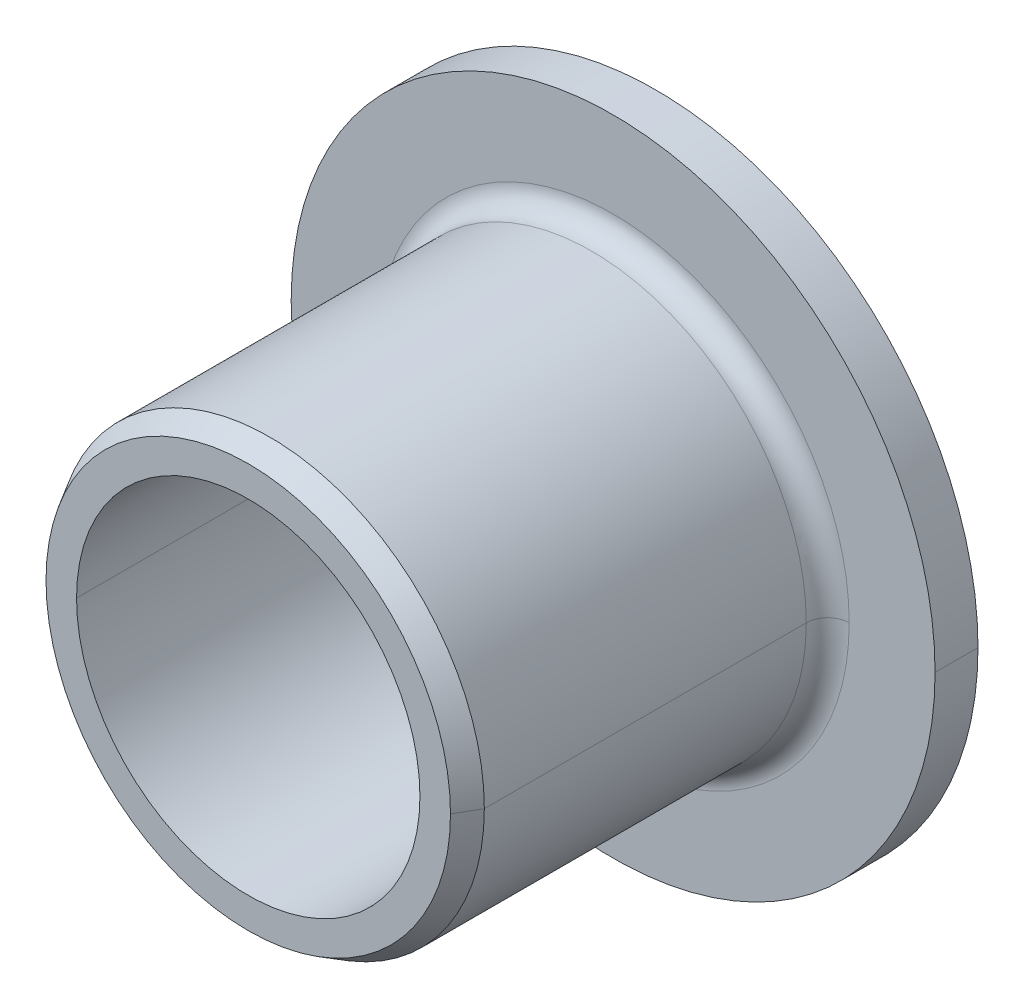
ISO-10303-21;
HEADER;
FILE_DESCRIPTION(('STEP AP214'),'2;1');
FILE_NAME('part.step','',(''),(''),'','','');
FILE_SCHEMA(('AUTOMOTIVE_DESIGN { 1 0 10303 214 1 1 1 1 }'));
ENDSEC;
DATA;
#1=APPLICATION_CONTEXT('core data for automotive mechanical design processes');
#2=APPLICATION_PROTOCOL_DEFINITION('international standard','automotive_design',2000,#1);
#3=PRODUCT_CONTEXT('',#1,'mechanical');
#4=PRODUCT('Part','Part','',(#3));
#5=PRODUCT_RELATED_PRODUCT_CATEGORY('part','',(#4));
#6=PRODUCT_DEFINITION_FORMATION('','',#4);
#7=PRODUCT_DEFINITION_CONTEXT('part definition',#1,'design');
#8=PRODUCT_DEFINITION('design','',#6,#7);
#9=PRODUCT_DEFINITION_SHAPE('','',#8);
#10=(LENGTH_UNIT() NAMED_UNIT(*) SI_UNIT(.MILLI.,.METRE.));
#11=(NAMED_UNIT(*) PLANE_ANGLE_UNIT() SI_UNIT($,.RADIAN.));
#12=(NAMED_UNIT(*) SI_UNIT($,.STERADIAN.) SOLID_ANGLE_UNIT());
#13=UNCERTAINTY_MEASURE_WITH_UNIT(LENGTH_MEASURE(1.E-05),#10,'distance_accuracy_value','');
#14=(GEOMETRIC_REPRESENTATION_CONTEXT(3) GLOBAL_UNCERTAINTY_ASSIGNED_CONTEXT((#13)) GLOBAL_UNIT_ASSIGNED_CONTEXT((#10,
#11,#12)) REPRESENTATION_CONTEXT('',''));
#15=CARTESIAN_POINT('',(0.,0.,0.));
#16=DIRECTION('',(0.,0.,1.));
#17=DIRECTION('',(1.,0.,0.));
#18=AXIS2_PLACEMENT_3D('',#15,#16,#17);
#19=CARTESIAN_POINT('',(5.75,0.,0.));
#20=DIRECTION('',(0.,0.,-1.));
#21=DIRECTION('',(0.,-1.,0.));
#22=AXIS2_PLACEMENT_3D('',#19,#20,#21);
#23=PLANE('',#22);
#24=CARTESIAN_POINT('',(0.,0.,0.));
#25=DIRECTION('',(0.,0.,1.));
#26=DIRECTION('',(1.,0.,0.));
#27=AXIS2_PLACEMENT_3D('',#24,#25,#26);
#28=CIRCLE('',#27,4.);
#29=CARTESIAN_POINT('',(4.,0.,0.));
#30=VERTEX_POINT('',#29);
#31=CARTESIAN_POINT('',(-4.,0.,0.));
#32=VERTEX_POINT('',#31);
#33=EDGE_CURVE('E10',#30,#32,#28,.T.);
#34=ORIENTED_EDGE('',*,*,#33,.T.);
#35=CARTESIAN_POINT('',(0.,0.,0.));
#36=DIRECTION('',(0.,0.,1.));
#37=DIRECTION('',(1.,0.,0.));
#38=AXIS2_PLACEMENT_3D('',#35,#36,#37);
#39=CIRCLE('',#38,4.);
#40=EDGE_CURVE('E145',#32,#30,#39,.T.);
#41=ORIENTED_EDGE('',*,*,#40,.T.);
#42=EDGE_LOOP('',(#34,#41));
#43=FACE_BOUND('',#42,.T.);
#44=CARTESIAN_POINT('',(0.,0.,0.));
#45=DIRECTION('',(0.,0.,1.));
#46=DIRECTION('',(1.,0.,0.));
#47=AXIS2_PLACEMENT_3D('',#44,#45,#46);
#48=CIRCLE('',#47,7.5);
#49=CARTESIAN_POINT('',(7.5,0.,0.));
#50=VERTEX_POINT('',#49);
#51=CARTESIAN_POINT('',(-7.5,0.,0.));
#52=VERTEX_POINT('',#51);
#53=EDGE_CURVE('E153',#50,#52,#48,.T.);
#54=ORIENTED_EDGE('',*,*,#53,.F.);
#55=CARTESIAN_POINT('',(0.,0.,0.));
#56=DIRECTION('',(0.,0.,1.));
#57=DIRECTION('',(1.,0.,0.));
#58=AXIS2_PLACEMENT_3D('',#55,#56,#57);
#59=CIRCLE('',#58,7.5);
#60=EDGE_CURVE('E110',#52,#50,#59,.T.);
#61=ORIENTED_EDGE('',*,*,#60,.F.);
#62=EDGE_LOOP('',(#54,#61));
#63=FACE_BOUND('',#62,.T.);
#64=ADVANCED_FACE('F16',(#43,#63),#23,.T.);
#65=CARTESIAN_POINT('',(0.,0.,4.75));
#66=DIRECTION('',(0.,0.,1.));
#67=DIRECTION('',(1.,0.,0.));
#68=AXIS2_PLACEMENT_3D('',#65,#66,#67);
#69=CYLINDRICAL_SURFACE('',#68,4.);
#70=DIRECTION('',(0.,0.,1.));
#71=VECTOR('',#70,1.);
#72=CARTESIAN_POINT('',(4.,0.,4.75));
#73=LINE('',#72,#71);
#74=CARTESIAN_POINT('',(4.,0.,9.5));
#75=VERTEX_POINT('',#74);
#76=EDGE_CURVE('E150',#30,#75,#73,.T.);
#77=ORIENTED_EDGE('',*,*,#76,.T.);
#78=CARTESIAN_POINT('',(0.,0.,9.5));
#79=DIRECTION('',(0.,0.,1.));
#80=DIRECTION('',(1.,0.,0.));
#81=AXIS2_PLACEMENT_3D('',#78,#79,#80);
#82=CIRCLE('',#81,4.);
#83=CARTESIAN_POINT('',(-4.,0.,9.5));
#84=VERTEX_POINT('',#83);
#85=EDGE_CURVE('E27',#75,#84,#82,.T.);
#86=ORIENTED_EDGE('',*,*,#85,.T.);
#87=DIRECTION('',(0.,0.,-1.));
#88=VECTOR('',#87,1.);
#89=CARTESIAN_POINT('',(-4.,0.,4.75));
#90=LINE('',#89,#88);
#91=EDGE_CURVE('E149',#84,#32,#90,.T.);
#92=ORIENTED_EDGE('',*,*,#91,.T.);
#93=ORIENTED_EDGE('',*,*,#33,.F.);
#94=EDGE_LOOP('',(#77,#86,#92,#93));
#95=FACE_BOUND('',#94,.T.);
#96=ADVANCED_FACE('F210',(#95),#69,.F.);
#97=CARTESIAN_POINT('',(4.3556624327,0.,9.5));
#98=DIRECTION('',(0.,0.,1.));
#99=DIRECTION('',(1.,0.,0.));
#100=AXIS2_PLACEMENT_3D('',#97,#98,#99);
#101=PLANE('',#100);
#102=ORIENTED_EDGE('',*,*,#85,.F.);
#103=CARTESIAN_POINT('',(0.,0.,9.5));
#104=DIRECTION('',(0.,0.,1.));
#105=DIRECTION('',(1.,0.,0.));
#106=AXIS2_PLACEMENT_3D('',#103,#104,#105);
#107=CIRCLE('',#106,4.);
#108=EDGE_CURVE('E159',#84,#75,#107,.T.);
#109=ORIENTED_EDGE('',*,*,#108,.F.);
#110=EDGE_LOOP('',(#102,#109));
#111=FACE_BOUND('',#110,.T.);
#112=CARTESIAN_POINT('',(0.,0.,9.5));
#113=DIRECTION('',(0.,0.,1.));
#114=DIRECTION('',(1.,0.,0.));
#115=AXIS2_PLACEMENT_3D('',#112,#113,#114);
#116=CIRCLE('',#115,4.7113248654);
#117=CARTESIAN_POINT('',(4.7113248654,0.,9.5));
#118=VERTEX_POINT('',#117);
#119=CARTESIAN_POINT('',(-4.7113248654,0.,9.5));
#120=VERTEX_POINT('',#119);
#121=EDGE_CURVE('E158',#118,#120,#116,.T.);
#122=ORIENTED_EDGE('',*,*,#121,.T.);
#123=CARTESIAN_POINT('',(0.,0.,9.5));
#124=DIRECTION('',(0.,0.,1.));
#125=DIRECTION('',(1.,0.,0.));
#126=AXIS2_PLACEMENT_3D('',#123,#124,#125);
#127=CIRCLE('',#126,4.7113248654);
#128=EDGE_CURVE('E141',#120,#118,#127,.T.);
#129=ORIENTED_EDGE('',*,*,#128,.T.);
#130=EDGE_LOOP('',(#122,#129));
#131=FACE_BOUND('',#130,.T.);
#132=ADVANCED_FACE('F18',(#111,#131),#101,.T.);
#133=CARTESIAN_POINT('',(0.,0.,9.25));
#134=DIRECTION('',(0.,0.,-1.));
#135=DIRECTION('',(1.,0.,0.));
#136=AXIS2_PLACEMENT_3D('',#133,#134,#135);
#137=CONICAL_SURFACE('',#136,4.8556624327,0.52359877560608);
#138=DIRECTION('',(-0.500000000006738,0.,0.866025403780548));
#139=VECTOR('',#138,1.);
#140=CARTESIAN_POINT('',(4.8556624327,0.,9.25));
#141=LINE('',#140,#139);
#142=CARTESIAN_POINT('',(5.,0.,9.));
#143=VERTEX_POINT('',#142);
#144=EDGE_CURVE('E163',#143,#118,#141,.T.);
#145=ORIENTED_EDGE('',*,*,#144,.T.);
#146=ORIENTED_EDGE('',*,*,#128,.F.);
#147=DIRECTION('',(-0.500000000006738,0.,-0.866025403780548));
#148=VECTOR('',#147,1.);
#149=CARTESIAN_POINT('',(-4.8556624327,0.,9.25));
#150=LINE('',#149,#148);
#151=CARTESIAN_POINT('',(-5.,0.,9.));
#152=VERTEX_POINT('',#151);
#153=EDGE_CURVE('E154',#120,#152,#150,.T.);
#154=ORIENTED_EDGE('',*,*,#153,.T.);
#155=CARTESIAN_POINT('',(0.,0.,9.));
#156=DIRECTION('',(0.,0.,1.));
#157=DIRECTION('',(1.,0.,0.));
#158=AXIS2_PLACEMENT_3D('',#155,#156,#157);
#159=CIRCLE('',#158,5.);
#160=EDGE_CURVE('E109',#152,#143,#159,.T.);
#161=ORIENTED_EDGE('',*,*,#160,.T.);
#162=EDGE_LOOP('',(#145,#146,#154,#161));
#163=FACE_BOUND('',#162,.T.);
#164=ADVANCED_FACE('F199',(#163),#137,.T.);
#165=CARTESIAN_POINT('',(0.,0.,5.25));
#166=DIRECTION('',(0.,0.,1.));
#167=DIRECTION('',(1.,0.,0.));
#168=AXIS2_PLACEMENT_3D('',#165,#166,#167);
#169=CYLINDRICAL_SURFACE('',#168,5.);
#170=DIRECTION('',(0.,0.,1.));
#171=VECTOR('',#170,1.);
#172=CARTESIAN_POINT('',(5.,0.,5.25));
#173=LINE('',#172,#171);
#174=CARTESIAN_POINT('',(5.,0.,1.5));
#175=VERTEX_POINT('',#174);
#176=EDGE_CURVE('E169',#175,#143,#173,.T.);
#177=ORIENTED_EDGE('',*,*,#176,.T.);
#178=ORIENTED_EDGE('',*,*,#160,.F.);
#179=DIRECTION('',(0.,0.,-1.));
#180=VECTOR('',#179,1.);
#181=CARTESIAN_POINT('',(-5.,0.,5.25));
#182=LINE('',#181,#180);
#183=CARTESIAN_POINT('',(-5.,0.,1.5));
#184=VERTEX_POINT('',#183);
#185=EDGE_CURVE('E121',#152,#184,#182,.T.);
#186=ORIENTED_EDGE('',*,*,#185,.T.);
#187=CARTESIAN_POINT('',(0.,0.,1.5));
#188=DIRECTION('',(0.,0.,1.));
#189=DIRECTION('',(1.,0.,0.));
#190=AXIS2_PLACEMENT_3D('',#187,#188,#189);
#191=CIRCLE('',#190,5.);
#192=EDGE_CURVE('E119',#184,#175,#191,.T.);
#193=ORIENTED_EDGE('',*,*,#192,.T.);
#194=EDGE_LOOP('',(#177,#178,#186,#193));
#195=FACE_BOUND('',#194,.T.);
#196=ADVANCED_FACE('F203',(#195),#169,.T.);
#197=CARTESIAN_POINT('',(0.,0.,1.5));
#198=DIRECTION('',(0.,0.,1.));
#199=DIRECTION('',(1.,0.,0.));
#200=AXIS2_PLACEMENT_3D('',#197,#198,#199);
#201=TOROIDAL_SURFACE('',#200,5.5,0.5);
#202=CARTESIAN_POINT('',(-5.5,0.,1.5));
#203=DIRECTION('',(0.,-1.,0.));
#204=DIRECTION('',(-1.,0.,0.));
#205=AXIS2_PLACEMENT_3D('',#202,#203,#204);
#206=CIRCLE('',#205,0.5);
#207=CARTESIAN_POINT('',(-5.5,0.,1.));
#208=VERTEX_POINT('',#207);
#209=EDGE_CURVE('E102',#208,#184,#206,.T.);
#210=ORIENTED_EDGE('',*,*,#209,.T.);
#211=CARTESIAN_POINT('',(0.,0.,1.5));
#212=DIRECTION('',(0.,0.,1.));
#213=DIRECTION('',(1.,0.,0.));
#214=AXIS2_PLACEMENT_3D('',#211,#212,#213);
#215=CIRCLE('',#214,5.);
#216=EDGE_CURVE('E127',#175,#184,#215,.T.);
#217=ORIENTED_EDGE('',*,*,#216,.F.);
#218=CARTESIAN_POINT('',(5.5,0.,1.5));
#219=DIRECTION('',(0.,-1.,0.));
#220=DIRECTION('',(1.,0.,0.));
#221=AXIS2_PLACEMENT_3D('',#218,#219,#220);
#222=CIRCLE('',#221,0.5);
#223=CARTESIAN_POINT('',(5.5,0.,1.));
#224=VERTEX_POINT('',#223);
#225=EDGE_CURVE('E105',#175,#224,#222,.T.);
#226=ORIENTED_EDGE('',*,*,#225,.T.);
#227=CARTESIAN_POINT('',(0.,0.,1.));
#228=DIRECTION('',(0.,0.,1.));
#229=DIRECTION('',(1.,0.,0.));
#230=AXIS2_PLACEMENT_3D('',#227,#228,#229);
#231=CIRCLE('',#230,5.5);
#232=EDGE_CURVE('E97',#224,#208,#231,.T.);
#233=ORIENTED_EDGE('',*,*,#232,.T.);
#234=EDGE_LOOP('',(#210,#217,#226,#233));
#235=FACE_BOUND('',#234,.T.);
#236=ADVANCED_FACE('F99',(#235),#201,.F.);
#237=CARTESIAN_POINT('',(6.5,0.,1.));
#238=DIRECTION('',(0.,0.,1.));
#239=DIRECTION('',(1.,0.,0.));
#240=AXIS2_PLACEMENT_3D('',#237,#238,#239);
#241=PLANE('',#240);
#242=ORIENTED_EDGE('',*,*,#232,.F.);
#243=CARTESIAN_POINT('',(0.,0.,1.));
#244=DIRECTION('',(0.,0.,1.));
#245=DIRECTION('',(1.,0.,0.));
#246=AXIS2_PLACEMENT_3D('',#243,#244,#245);
#247=CIRCLE('',#246,5.5);
#248=EDGE_CURVE('E112',#208,#224,#247,.T.);
#249=ORIENTED_EDGE('',*,*,#248,.F.);
#250=EDGE_LOOP('',(#242,#249));
#251=FACE_BOUND('',#250,.T.);
#252=CARTESIAN_POINT('',(0.,0.,1.));
#253=DIRECTION('',(0.,0.,1.));
#254=DIRECTION('',(1.,0.,0.));
#255=AXIS2_PLACEMENT_3D('',#252,#253,#254);
#256=CIRCLE('',#255,7.5);
#257=CARTESIAN_POINT('',(7.5,0.,1.));
#258=VERTEX_POINT('',#257);
#259=CARTESIAN_POINT('',(-7.5,0.,1.));
#260=VERTEX_POINT('',#259);
#261=EDGE_CURVE('E134',#258,#260,#256,.T.);
#262=ORIENTED_EDGE('',*,*,#261,.T.);
#263=CARTESIAN_POINT('',(0.,0.,1.));
#264=DIRECTION('',(0.,0.,1.));
#265=DIRECTION('',(1.,0.,0.));
#266=AXIS2_PLACEMENT_3D('',#263,#264,#265);
#267=CIRCLE('',#266,7.5);
#268=EDGE_CURVE('E39',#260,#258,#267,.T.);
#269=ORIENTED_EDGE('',*,*,#268,.T.);
#270=EDGE_LOOP('',(#262,#269));
#271=FACE_BOUND('',#270,.T.);
#272=ADVANCED_FACE('F113',(#251,#271),#241,.T.);
#273=CARTESIAN_POINT('',(0.,0.,0.5));
#274=DIRECTION('',(0.,0.,1.));
#275=DIRECTION('',(1.,0.,0.));
#276=AXIS2_PLACEMENT_3D('',#273,#274,#275);
#277=CYLINDRICAL_SURFACE('',#276,7.5);
#278=DIRECTION('',(0.,0.,1.));
#279=VECTOR('',#278,1.);
#280=CARTESIAN_POINT('',(7.5,0.,0.5));
#281=LINE('',#280,#279);
#282=EDGE_CURVE('E144',#50,#258,#281,.T.);
#283=ORIENTED_EDGE('',*,*,#282,.T.);
#284=ORIENTED_EDGE('',*,*,#268,.F.);
#285=DIRECTION('',(0.,0.,-1.));
#286=VECTOR('',#285,1.);
#287=CARTESIAN_POINT('',(-7.5,0.,0.5));
#288=LINE('',#287,#286);
#289=EDGE_CURVE('E20',#260,#52,#288,.T.);
#290=ORIENTED_EDGE('',*,*,#289,.T.);
#291=ORIENTED_EDGE('',*,*,#60,.T.);
#292=EDGE_LOOP('',(#283,#284,#290,#291));
#293=FACE_BOUND('',#292,.T.);
#294=ADVANCED_FACE('F230',(#293),#277,.T.);
#295=CARTESIAN_POINT('',(0.,0.,0.5));
#296=DIRECTION('',(0.,0.,1.));
#297=DIRECTION('',(1.,0.,0.));
#298=AXIS2_PLACEMENT_3D('',#295,#296,#297);
#299=CYLINDRICAL_SURFACE('',#298,7.5);
#300=ORIENTED_EDGE('',*,*,#282,.F.);
#301=ORIENTED_EDGE('',*,*,#53,.T.);
#302=ORIENTED_EDGE('',*,*,#289,.F.);
#303=ORIENTED_EDGE('',*,*,#261,.F.);
#304=EDGE_LOOP('',(#300,#301,#302,#303));
#305=FACE_BOUND('',#304,.T.);
#306=ADVANCED_FACE('F232',(#305),#299,.T.);
#307=CARTESIAN_POINT('',(0.,0.,1.5));
#308=DIRECTION('',(0.,0.,1.));
#309=DIRECTION('',(1.,0.,0.));
#310=AXIS2_PLACEMENT_3D('',#307,#308,#309);
#311=TOROIDAL_SURFACE('',#310,5.5,0.5);
#312=ORIENTED_EDGE('',*,*,#209,.F.);
#313=ORIENTED_EDGE('',*,*,#248,.T.);
#314=ORIENTED_EDGE('',*,*,#225,.F.);
#315=ORIENTED_EDGE('',*,*,#192,.F.);
#316=EDGE_LOOP('',(#312,#313,#314,#315));
#317=FACE_BOUND('',#316,.T.);
#318=ADVANCED_FACE('F118',(#317),#311,.F.);
#319=CARTESIAN_POINT('',(0.,0.,5.25));
#320=DIRECTION('',(0.,0.,1.));
#321=DIRECTION('',(1.,0.,0.));
#322=AXIS2_PLACEMENT_3D('',#319,#320,#321);
#323=CYLINDRICAL_SURFACE('',#322,5.);
#324=ORIENTED_EDGE('',*,*,#176,.F.);
#325=ORIENTED_EDGE('',*,*,#216,.T.);
#326=ORIENTED_EDGE('',*,*,#185,.F.);
#327=CARTESIAN_POINT('',(0.,0.,9.));
#328=DIRECTION('',(0.,0.,1.));
#329=DIRECTION('',(1.,0.,0.));
#330=AXIS2_PLACEMENT_3D('',#327,#328,#329);
#331=CIRCLE('',#330,5.);
#332=EDGE_CURVE('E131',#143,#152,#331,.T.);
#333=ORIENTED_EDGE('',*,*,#332,.F.);
#334=EDGE_LOOP('',(#324,#325,#326,#333));
#335=FACE_BOUND('',#334,.T.);
#336=ADVANCED_FACE('F204',(#335),#323,.T.);
#337=CARTESIAN_POINT('',(0.,0.,9.25));
#338=DIRECTION('',(0.,0.,-1.));
#339=DIRECTION('',(1.,0.,0.));
#340=AXIS2_PLACEMENT_3D('',#337,#338,#339);
#341=CONICAL_SURFACE('',#340,4.8556624327,0.52359877560608);
#342=ORIENTED_EDGE('',*,*,#144,.F.);
#343=ORIENTED_EDGE('',*,*,#332,.T.);
#344=ORIENTED_EDGE('',*,*,#153,.F.);
#345=ORIENTED_EDGE('',*,*,#121,.F.);
#346=EDGE_LOOP('',(#342,#343,#344,#345));
#347=FACE_BOUND('',#346,.T.);
#348=ADVANCED_FACE('F207',(#347),#341,.T.);
#349=CARTESIAN_POINT('',(0.,0.,4.75));
#350=DIRECTION('',(0.,0.,1.));
#351=DIRECTION('',(1.,0.,0.));
#352=AXIS2_PLACEMENT_3D('',#349,#350,#351);
#353=CYLINDRICAL_SURFACE('',#352,4.);
#354=ORIENTED_EDGE('',*,*,#76,.F.);
#355=ORIENTED_EDGE('',*,*,#40,.F.);
#356=ORIENTED_EDGE('',*,*,#91,.F.);
#357=ORIENTED_EDGE('',*,*,#108,.T.);
#358=EDGE_LOOP('',(#354,#355,#356,#357));
#359=FACE_BOUND('',#358,.T.);
#360=ADVANCED_FACE('F238',(#359),#353,.F.);
#361=CLOSED_SHELL('',(#64,#96,#132,#164,#196,#236,#272,#294,#306,#318,#336,#348,#360));
#362=MANIFOLD_SOLID_BREP('B1',#361);
#363=ADVANCED_BREP_SHAPE_REPRESENTATION('',(#18,#362),#14);
#364=SHAPE_DEFINITION_REPRESENTATION(#9,#363);
ENDSEC;
END-ISO-10303-21;
